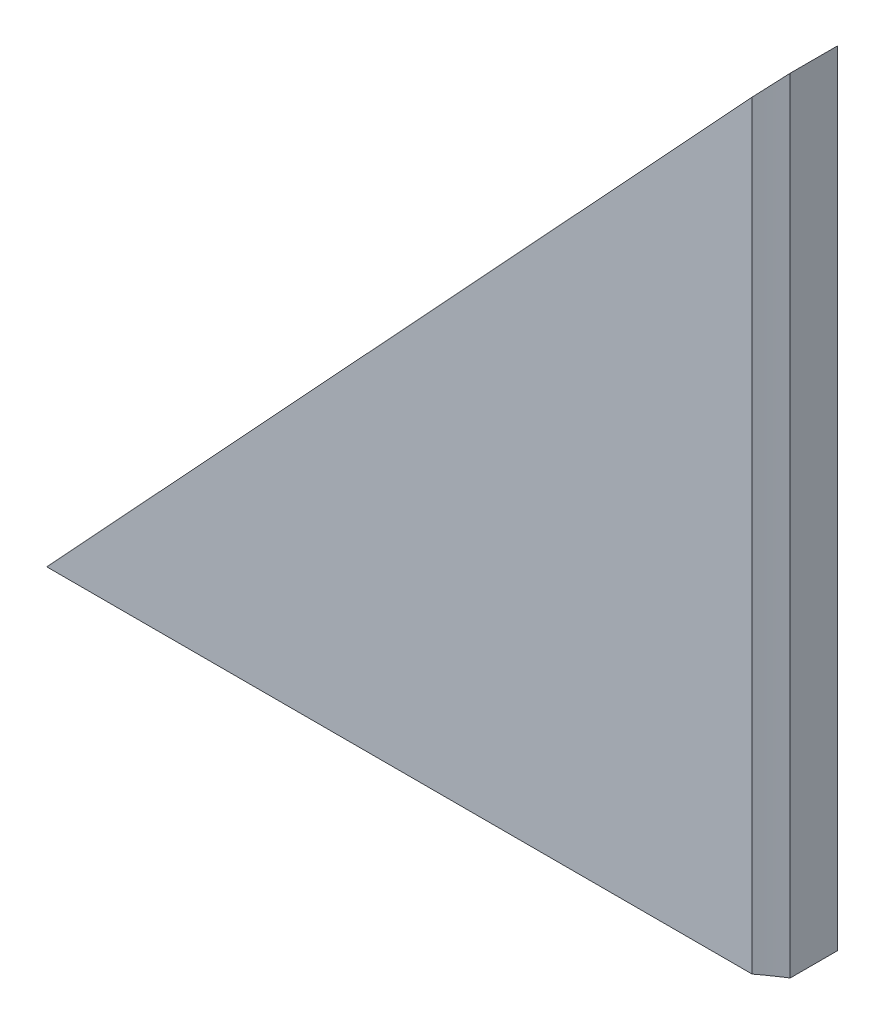
ISO-10303-21;
HEADER;
FILE_DESCRIPTION(('STEP AP214'),'2;1');
FILE_NAME('part.step','',(''),(''),'','','');
FILE_SCHEMA(('AUTOMOTIVE_DESIGN { 1 0 10303 214 1 1 1 1 }'));
ENDSEC;
DATA;
#1=APPLICATION_CONTEXT('core data for automotive mechanical design processes');
#2=APPLICATION_PROTOCOL_DEFINITION('international standard','automotive_design',2000,#1);
#3=PRODUCT_CONTEXT('',#1,'mechanical');
#4=PRODUCT('Part','Part','',(#3));
#5=PRODUCT_RELATED_PRODUCT_CATEGORY('part','',(#4));
#6=PRODUCT_DEFINITION_FORMATION('','',#4);
#7=PRODUCT_DEFINITION_CONTEXT('part definition',#1,'design');
#8=PRODUCT_DEFINITION('design','',#6,#7);
#9=PRODUCT_DEFINITION_SHAPE('','',#8);
#10=(LENGTH_UNIT() NAMED_UNIT(*) SI_UNIT(.MILLI.,.METRE.));
#11=(NAMED_UNIT(*) PLANE_ANGLE_UNIT() SI_UNIT($,.RADIAN.));
#12=(NAMED_UNIT(*) SI_UNIT($,.STERADIAN.) SOLID_ANGLE_UNIT());
#13=UNCERTAINTY_MEASURE_WITH_UNIT(LENGTH_MEASURE(1.E-05),#10,'distance_accuracy_value','');
#14=(GEOMETRIC_REPRESENTATION_CONTEXT(3) GLOBAL_UNCERTAINTY_ASSIGNED_CONTEXT((#13)) GLOBAL_UNIT_ASSIGNED_CONTEXT((#10,
#11,#12)) REPRESENTATION_CONTEXT('',''));
#15=CARTESIAN_POINT('',(0.,0.,0.));
#16=DIRECTION('',(0.,0.,1.));
#17=DIRECTION('',(1.,0.,0.));
#18=AXIS2_PLACEMENT_3D('',#15,#16,#17);
#19=CARTESIAN_POINT('',(0.,0.,0.5));
#20=DIRECTION('',(0.,-1.,0.));
#21=DIRECTION('',(1.,0.,0.));
#22=AXIS2_PLACEMENT_3D('',#19,#20,#21);
#23=PLANE('',#22);
#24=CARTESIAN_POINT('',(6.78,0.,10.501504654096));
#25=DIRECTION('',(0.,-1.,0.));
#26=DIRECTION('',(1.,0.,0.));
#27=AXIS2_PLACEMENT_3D('',#24,#25,#26);
#28=CIRCLE('',#27,12.5);
#29=CARTESIAN_POINT('',(-0.717993375170194,0.,0.5));
#30=VERTEX_POINT('',#29);
#31=CARTESIAN_POINT('',(0.,0.,0.));
#32=VERTEX_POINT('',#31);
#33=EDGE_CURVE('E104',#30,#32,#28,.T.);
#34=ORIENTED_EDGE('',*,*,#33,.F.);
#35=DIRECTION('',(-1.,0.,0.));
#36=VECTOR('',#35,1.);
#37=CARTESIAN_POINT('',(0.,0.,0.5));
#38=LINE('',#37,#36);
#39=CARTESIAN_POINT('',(-23.22,0.,0.5));
#40=VERTEX_POINT('',#39);
#41=EDGE_CURVE('E60',#30,#40,#38,.T.);
#42=ORIENTED_EDGE('',*,*,#41,.T.);
#43=DIRECTION('',(0.,0.,-1.));
#44=VECTOR('',#43,1.);
#45=CARTESIAN_POINT('',(-23.22,0.,0.5));
#46=LINE('',#45,#44);
#47=CARTESIAN_POINT('',(-23.22,0.,-1.5));
#48=VERTEX_POINT('',#47);
#49=EDGE_CURVE('E83',#40,#48,#46,.T.);
#50=ORIENTED_EDGE('',*,*,#49,.T.);
#51=DIRECTION('',(-1.,0.,0.));
#52=VECTOR('',#51,1.);
#53=CARTESIAN_POINT('',(0.,0.,-1.5));
#54=LINE('',#53,#52);
#55=CARTESIAN_POINT('',(0.,0.,-1.5));
#56=VERTEX_POINT('',#55);
#57=EDGE_CURVE('E90',#56,#48,#54,.T.);
#58=ORIENTED_EDGE('',*,*,#57,.F.);
#59=DIRECTION('',(0.,0.,-1.));
#60=VECTOR('',#59,1.);
#61=CARTESIAN_POINT('',(0.,0.,0.5));
#62=LINE('',#61,#60);
#63=EDGE_CURVE('E45',#32,#56,#62,.T.);
#64=ORIENTED_EDGE('',*,*,#63,.F.);
#65=EDGE_LOOP('',(#34,#42,#50,#58,#64));
#66=FACE_BOUND('',#65,.T.);
#67=ADVANCED_FACE('F38',(#66),#23,.T.);
#68=CARTESIAN_POINT('',(0.,25.,0.5));
#69=DIRECTION('',(1.,0.,0.));
#70=DIRECTION('',(0.,1.,0.));
#71=AXIS2_PLACEMENT_3D('',#68,#69,#70);
#72=PLANE('',#71);
#73=DIRECTION('',(0.,-1.,0.));
#74=VECTOR('',#73,1.);
#75=CARTESIAN_POINT('',(0.,25.,0.));
#76=LINE('',#75,#74);
#77=CARTESIAN_POINT('',(0.,25.,0.));
#78=VERTEX_POINT('',#77);
#79=EDGE_CURVE('E102',#32,#78,#76,.F.);
#80=ORIENTED_EDGE('',*,*,#79,.F.);
#81=ORIENTED_EDGE('',*,*,#63,.T.);
#82=DIRECTION('',(0.,-1.,0.));
#83=VECTOR('',#82,1.);
#84=CARTESIAN_POINT('',(0.,25.,-1.5));
#85=LINE('',#84,#83);
#86=CARTESIAN_POINT('',(0.,25.,-1.5));
#87=VERTEX_POINT('',#86);
#88=EDGE_CURVE('E88',#87,#56,#85,.T.);
#89=ORIENTED_EDGE('',*,*,#88,.F.);
#90=DIRECTION('',(0.,0.,-1.));
#91=VECTOR('',#90,1.);
#92=CARTESIAN_POINT('',(0.,25.,0.5));
#93=LINE('',#92,#91);
#94=EDGE_CURVE('E74',#78,#87,#93,.T.);
#95=ORIENTED_EDGE('',*,*,#94,.F.);
#96=EDGE_LOOP('',(#80,#81,#89,#95));
#97=FACE_BOUND('',#96,.T.);
#98=ADVANCED_FACE('F92',(#97),#72,.T.);
#99=CARTESIAN_POINT('',(-23.22,0.,0.5));
#100=DIRECTION('',(-0.732709977244616,0.680541026864799,0.));
#101=DIRECTION('',(-0.680541026864799,-0.732709977244616,0.));
#102=AXIS2_PLACEMENT_3D('',#99,#100,#101);
#103=PLANE('',#102);
#104=CARTESIAN_POINT('',(6.78000000000001,32.2997416020672,10.501504654096));
#105=DIRECTION('',(-0.732709977244616,0.680541026864799,0.));
#106=DIRECTION('',(-0.680541026864799,-0.732709977244616,0.));
#107=AXIS2_PLACEMENT_3D('',#104,#105,#106);
#108=ELLIPSE('',#107,18.3677390584173,12.5);
#109=CARTESIAN_POINT('',(-0.71799337517019,24.2269666503336,0.5));
#110=VERTEX_POINT('',#109);
#111=EDGE_CURVE('E51',#78,#110,#108,.T.);
#112=ORIENTED_EDGE('',*,*,#111,.F.);
#113=ORIENTED_EDGE('',*,*,#94,.T.);
#114=DIRECTION('',(0.680541026864799,0.732709977244616,0.));
#115=VECTOR('',#114,1.);
#116=CARTESIAN_POINT('',(-23.22,0.,-1.5));
#117=LINE('',#116,#115);
#118=EDGE_CURVE('E77',#48,#87,#117,.T.);
#119=ORIENTED_EDGE('',*,*,#118,.F.);
#120=ORIENTED_EDGE('',*,*,#49,.F.);
#121=DIRECTION('',(0.680541026864799,0.732709977244616,0.));
#122=VECTOR('',#121,1.);
#123=CARTESIAN_POINT('',(-23.22,0.,0.5));
#124=LINE('',#123,#122);
#125=EDGE_CURVE('E95',#40,#110,#124,.T.);
#126=ORIENTED_EDGE('',*,*,#125,.T.);
#127=EDGE_LOOP('',(#112,#113,#119,#120,#126));
#128=FACE_BOUND('',#127,.T.);
#129=ADVANCED_FACE('F76',(#128),#103,.T.);
#130=CARTESIAN_POINT('',(0.,0.,0.5));
#131=DIRECTION('',(0.,0.,1.));
#132=DIRECTION('',(1.,0.,0.));
#133=AXIS2_PLACEMENT_3D('',#130,#131,#132);
#134=PLANE('',#133);
#135=DIRECTION('',(0.,-1.,0.));
#136=VECTOR('',#135,1.);
#137=CARTESIAN_POINT('',(-0.717993375170187,25.,0.5));
#138=LINE('',#137,#136);
#139=EDGE_CURVE('E11',#110,#30,#138,.T.);
#140=ORIENTED_EDGE('',*,*,#139,.F.);
#141=ORIENTED_EDGE('',*,*,#125,.F.);
#142=ORIENTED_EDGE('',*,*,#41,.F.);
#143=EDGE_LOOP('',(#140,#141,#142));
#144=FACE_BOUND('',#143,.T.);
#145=ADVANCED_FACE('F118',(#144),#134,.T.);
#146=CARTESIAN_POINT('',(0.,0.,-1.5));
#147=DIRECTION('',(0.,0.,1.));
#148=DIRECTION('',(1.,0.,0.));
#149=AXIS2_PLACEMENT_3D('',#146,#147,#148);
#150=PLANE('',#149);
#151=ORIENTED_EDGE('',*,*,#57,.T.);
#152=ORIENTED_EDGE('',*,*,#118,.T.);
#153=ORIENTED_EDGE('',*,*,#88,.T.);
#154=EDGE_LOOP('',(#151,#152,#153));
#155=FACE_BOUND('',#154,.T.);
#156=ADVANCED_FACE('F87',(#155),#150,.F.);
#157=CARTESIAN_POINT('',(6.78000000000001,25.,10.501504654096));
#158=DIRECTION('',(0.,-1.,0.));
#159=DIRECTION('',(1.,0.,0.));
#160=AXIS2_PLACEMENT_3D('',#157,#158,#159);
#161=CYLINDRICAL_SURFACE('',#160,12.5);
#162=ORIENTED_EDGE('',*,*,#79,.T.);
#163=ORIENTED_EDGE('',*,*,#111,.T.);
#164=ORIENTED_EDGE('',*,*,#139,.T.);
#165=ORIENTED_EDGE('',*,*,#33,.T.);
#166=EDGE_LOOP('',(#162,#163,#164,#165));
#167=FACE_BOUND('',#166,.T.);
#168=ADVANCED_FACE('F108',(#167),#161,.F.);
#169=CLOSED_SHELL('',(#67,#98,#129,#145,#156,#168));
#170=MANIFOLD_SOLID_BREP('B2',#169);
#171=ADVANCED_BREP_SHAPE_REPRESENTATION('',(#18,#170),#14);
#172=SHAPE_DEFINITION_REPRESENTATION(#9,#171);
ENDSEC;
END-ISO-10303-21;
